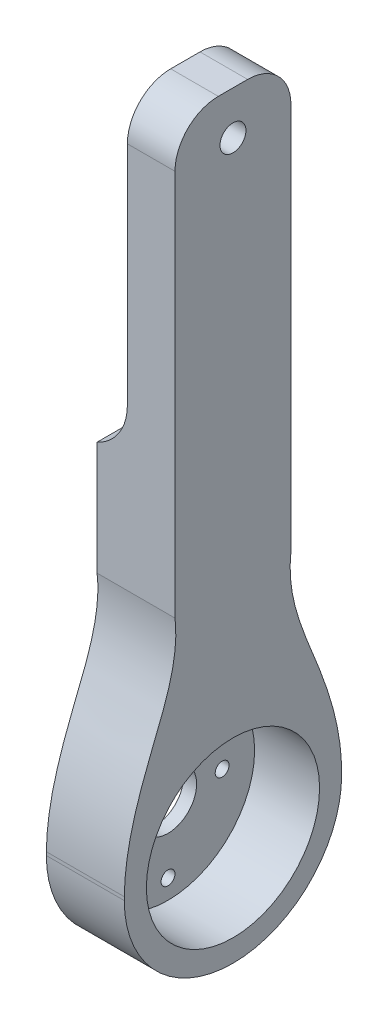
ISO-10303-21;
HEADER;
FILE_DESCRIPTION(('STEP AP214'),'2;1');
FILE_NAME('part.step','',(''),(''),'','','');
FILE_SCHEMA(('AUTOMOTIVE_DESIGN { 1 0 10303 214 1 1 1 1 }'));
ENDSEC;
DATA;
#1=APPLICATION_CONTEXT('core data for automotive mechanical design processes');
#2=APPLICATION_PROTOCOL_DEFINITION('international standard','automotive_design',2000,#1);
#3=PRODUCT_CONTEXT('',#1,'mechanical');
#4=PRODUCT('Part','Part','',(#3));
#5=PRODUCT_RELATED_PRODUCT_CATEGORY('part','',(#4));
#6=PRODUCT_DEFINITION_FORMATION('','',#4);
#7=PRODUCT_DEFINITION_CONTEXT('part definition',#1,'design');
#8=PRODUCT_DEFINITION('design','',#6,#7);
#9=PRODUCT_DEFINITION_SHAPE('','',#8);
#10=(LENGTH_UNIT() NAMED_UNIT(*) SI_UNIT(.MILLI.,.METRE.));
#11=(NAMED_UNIT(*) PLANE_ANGLE_UNIT() SI_UNIT($,.RADIAN.));
#12=(NAMED_UNIT(*) SI_UNIT($,.STERADIAN.) SOLID_ANGLE_UNIT());
#13=UNCERTAINTY_MEASURE_WITH_UNIT(LENGTH_MEASURE(1.E-05),#10,'distance_accuracy_value','');
#14=(GEOMETRIC_REPRESENTATION_CONTEXT(3) GLOBAL_UNCERTAINTY_ASSIGNED_CONTEXT((#13)) GLOBAL_UNIT_ASSIGNED_CONTEXT((#10,
#11,#12)) REPRESENTATION_CONTEXT('',''));
#15=CARTESIAN_POINT('',(0.,0.,0.));
#16=DIRECTION('',(0.,0.,1.));
#17=DIRECTION('',(1.,0.,0.));
#18=AXIS2_PLACEMENT_3D('',#15,#16,#17);
#19=CARTESIAN_POINT('',(1.5,10.8267780737383,-2.98337884698565));
#20=DIRECTION('',(1.,0.,0.));
#21=DIRECTION('',(0.,0.,-1.));
#22=AXIS2_PLACEMENT_3D('',#19,#20,#21);
#23=PLANE('',#22);
#24=CARTESIAN_POINT('',(1.5,10.8267780737383,-2.98337884698565));
#25=DIRECTION('',(1.,0.,0.));
#26=DIRECTION('',(0.,0.,-1.));
#27=AXIS2_PLACEMENT_3D('',#24,#25,#26);
#28=CIRCLE('',#27,3.30176779282932);
#29=CARTESIAN_POINT('',(1.5,10.8267780737383,-6.28514663981497));
#30=VERTEX_POINT('',#29);
#31=EDGE_CURVE('E219',#30,#30,#28,.T.);
#32=ORIENTED_EDGE('',*,*,#31,.F.);
#33=EDGE_LOOP('',(#32));
#34=FACE_BOUND('',#33,.T.);
#35=CARTESIAN_POINT('',(1.5,3.07677807373827,-2.98337884698565));
#36=DIRECTION('',(1.,0.,0.));
#37=DIRECTION('',(0.,0.,-1.));
#38=AXIS2_PLACEMENT_3D('',#35,#36,#37);
#39=CIRCLE('',#38,0.799999999999999);
#40=CARTESIAN_POINT('',(1.5,3.07677807373827,-3.78337884698565));
#41=VERTEX_POINT('',#40);
#42=EDGE_CURVE('E231',#41,#41,#39,.T.);
#43=ORIENTED_EDGE('',*,*,#42,.F.);
#44=EDGE_LOOP('',(#43));
#45=FACE_BOUND('',#44,.T.);
#46=CARTESIAN_POINT('',(1.5,10.8267780737383,-2.98337884698565));
#47=DIRECTION('',(1.,0.,0.));
#48=DIRECTION('',(0.,0.,-1.));
#49=AXIS2_PLACEMENT_3D('',#46,#47,#48);
#50=CIRCLE('',#49,10.);
#51=CARTESIAN_POINT('',(1.5,10.8267780737383,-12.9833788469857));
#52=VERTEX_POINT('',#51);
#53=EDGE_CURVE('E208',#52,#52,#50,.T.);
#54=ORIENTED_EDGE('',*,*,#53,.T.);
#55=EDGE_LOOP('',(#54));
#56=FACE_BOUND('',#55,.T.);
#57=CARTESIAN_POINT('',(1.5,18.5767780737383,-2.98337884698565));
#58=DIRECTION('',(1.,0.,0.));
#59=DIRECTION('',(0.,0.,-1.));
#60=AXIS2_PLACEMENT_3D('',#57,#58,#59);
#61=CIRCLE('',#60,0.8);
#62=CARTESIAN_POINT('',(1.5,18.5767780737383,-3.78337884698565));
#63=VERTEX_POINT('',#62);
#64=EDGE_CURVE('E237',#63,#63,#61,.T.);
#65=ORIENTED_EDGE('',*,*,#64,.F.);
#66=EDGE_LOOP('',(#65));
#67=FACE_BOUND('',#66,.T.);
#68=CARTESIAN_POINT('',(1.5,10.8267780737383,3.26662115301435));
#69=DIRECTION('',(1.,0.,0.));
#70=DIRECTION('',(0.,0.,-1.));
#71=AXIS2_PLACEMENT_3D('',#68,#69,#70);
#72=CIRCLE('',#71,0.8);
#73=CARTESIAN_POINT('',(1.5,10.8267780737383,2.46662115301435));
#74=VERTEX_POINT('',#73);
#75=EDGE_CURVE('E225',#74,#74,#72,.T.);
#76=ORIENTED_EDGE('',*,*,#75,.F.);
#77=EDGE_LOOP('',(#76));
#78=FACE_BOUND('',#77,.T.);
#79=CARTESIAN_POINT('',(1.5,10.8267780737383,-9.23337884698565));
#80=DIRECTION('',(1.,0.,0.));
#81=DIRECTION('',(0.,0.,-1.));
#82=AXIS2_PLACEMENT_3D('',#79,#80,#81);
#83=CIRCLE('',#82,0.800000000000001);
#84=CARTESIAN_POINT('',(1.5,10.8267780737383,-10.0333788469857));
#85=VERTEX_POINT('',#84);
#86=EDGE_CURVE('E213',#85,#85,#83,.T.);
#87=ORIENTED_EDGE('',*,*,#86,.F.);
#88=EDGE_LOOP('',(#87));
#89=FACE_BOUND('',#88,.T.);
#90=ADVANCED_FACE('F35',(#34,#45,#56,#67,#78,#89),#23,.T.);
#91=CARTESIAN_POINT('',(0.,10.8267780737383,-2.98337884698565));
#92=DIRECTION('',(1.,0.,0.));
#93=DIRECTION('',(0.,0.,-1.));
#94=AXIS2_PLACEMENT_3D('',#91,#92,#93);
#95=PLANE('',#94);
#96=CARTESIAN_POINT('',(0.,18.5767780737383,-2.98337884698565));
#97=DIRECTION('',(1.,0.,0.));
#98=DIRECTION('',(0.,0.,-1.));
#99=AXIS2_PLACEMENT_3D('',#96,#97,#98);
#100=CIRCLE('',#99,0.8);
#101=CARTESIAN_POINT('',(0.,18.5767780737383,-3.78337884698565));
#102=VERTEX_POINT('',#101);
#103=EDGE_CURVE('E234',#102,#102,#100,.T.);
#104=ORIENTED_EDGE('',*,*,#103,.T.);
#105=EDGE_LOOP('',(#104));
#106=FACE_BOUND('',#105,.T.);
#107=CARTESIAN_POINT('',(0.,3.07677807373827,-2.98337884698565));
#108=DIRECTION('',(1.,0.,0.));
#109=DIRECTION('',(0.,0.,-1.));
#110=AXIS2_PLACEMENT_3D('',#107,#108,#109);
#111=CIRCLE('',#110,0.799999999999999);
#112=CARTESIAN_POINT('',(0.,3.07677807373827,-3.78337884698565));
#113=VERTEX_POINT('',#112);
#114=EDGE_CURVE('E228',#113,#113,#111,.T.);
#115=ORIENTED_EDGE('',*,*,#114,.T.);
#116=EDGE_LOOP('',(#115));
#117=FACE_BOUND('',#116,.T.);
#118=CARTESIAN_POINT('',(0.,10.8267780737383,3.26662115301435));
#119=DIRECTION('',(1.,0.,0.));
#120=DIRECTION('',(0.,0.,-1.));
#121=AXIS2_PLACEMENT_3D('',#118,#119,#120);
#122=CIRCLE('',#121,0.8);
#123=CARTESIAN_POINT('',(0.,10.8267780737383,2.46662115301435));
#124=VERTEX_POINT('',#123);
#125=EDGE_CURVE('E222',#124,#124,#122,.T.);
#126=ORIENTED_EDGE('',*,*,#125,.T.);
#127=EDGE_LOOP('',(#126));
#128=FACE_BOUND('',#127,.T.);
#129=CARTESIAN_POINT('',(0.,10.8267780737383,-2.98337884698565));
#130=DIRECTION('',(1.,0.,0.));
#131=DIRECTION('',(0.,0.,-1.));
#132=AXIS2_PLACEMENT_3D('',#129,#130,#131);
#133=CIRCLE('',#132,3.30176779282932);
#134=CARTESIAN_POINT('',(0.,10.8267780737383,-6.28514663981497));
#135=VERTEX_POINT('',#134);
#136=EDGE_CURVE('E216',#135,#135,#133,.T.);
#137=ORIENTED_EDGE('',*,*,#136,.T.);
#138=EDGE_LOOP('',(#137));
#139=FACE_BOUND('',#138,.T.);
#140=CARTESIAN_POINT('',(0.,10.8267780737383,-9.23337884698565));
#141=DIRECTION('',(1.,0.,0.));
#142=DIRECTION('',(0.,0.,-1.));
#143=AXIS2_PLACEMENT_3D('',#140,#141,#142);
#144=CIRCLE('',#143,0.800000000000001);
#145=CARTESIAN_POINT('',(0.,10.8267780737383,-10.0333788469857));
#146=VERTEX_POINT('',#145);
#147=EDGE_CURVE('E212',#146,#146,#144,.T.);
#148=ORIENTED_EDGE('',*,*,#147,.T.);
#149=EDGE_LOOP('',(#148));
#150=FACE_BOUND('',#149,.T.);
#151=DIRECTION('',(0.,1.,0.));
#152=VECTOR('',#151,1.);
#153=CARTESIAN_POINT('',(0.,36.1504126638392,3.70951793858332));
#154=LINE('',#153,#152);
#155=CARTESIAN_POINT('',(0.,36.1504126638392,3.70951793858332));
#156=VERTEX_POINT('',#155);
#157=CARTESIAN_POINT('',(0.,49.2404935822916,3.70951793858332));
#158=VERTEX_POINT('',#157);
#159=EDGE_CURVE('E261',#156,#158,#154,.T.);
#160=ORIENTED_EDGE('',*,*,#159,.T.);
#161=DIRECTION('',(0.,0.,-1.));
#162=VECTOR('',#161,1.);
#163=CARTESIAN_POINT('',(0.,49.2404935822916,-2.98337884698565));
#164=LINE('',#163,#162);
#165=CARTESIAN_POINT('',(0.,49.2404935822916,-9.67627563255461));
#166=VERTEX_POINT('',#165);
#167=EDGE_CURVE('E336',#158,#166,#164,.T.);
#168=ORIENTED_EDGE('',*,*,#167,.T.);
#169=DIRECTION('',(0.,-1.,0.));
#170=VECTOR('',#169,1.);
#171=CARTESIAN_POINT('',(0.,36.1504126638392,-9.67627563255461));
#172=LINE('',#171,#170);
#173=CARTESIAN_POINT('',(0.,36.1504126638392,-9.67627563255461));
#174=VERTEX_POINT('',#173);
#175=EDGE_CURVE('E258',#166,#174,#172,.T.);
#176=ORIENTED_EDGE('',*,*,#175,.T.);
#177=CARTESIAN_POINT('',(0.,36.1504126638392,-9.67627563255462));
#178=CARTESIAN_POINT('',(0.,31.470187844211,-9.12188079241383));
#179=CARTESIAN_POINT('',(0.,23.501097027703,-13.0526548593357));
#180=CARTESIAN_POINT('',(0.,15.1167109755813,-15.5695494666407));
#181=CARTESIAN_POINT('',(0.,10.8267780737383,-15.5319237412449));
#182=B_SPLINE_CURVE_WITH_KNOTS('',3,(#177,#178,#179,#180,#181),.UNSPECIFIED.,.F.,.F.,(4,1,4),
(0.,0.516043618335401,1.),.UNSPECIFIED.);
#183=CARTESIAN_POINT('',(0.,11.2146572929089,-15.5319237418595));
#184=VERTEX_POINT('',#183);
#185=EDGE_CURVE('E256',#174,#184,#182,.T.);
#186=ORIENTED_EDGE('',*,*,#185,.T.);
#187=DIRECTION('',(0.,-1.,0.));
#188=VECTOR('',#187,1.);
#189=CARTESIAN_POINT('',(0.,85.8267780737383,-15.531923741245));
#190=LINE('',#189,#188);
#191=CARTESIAN_POINT('',(0.,10.8267780737383,-15.5319237412449));
#192=VERTEX_POINT('',#191);
#193=EDGE_CURVE('E203',#184,#192,#190,.T.);
#194=ORIENTED_EDGE('',*,*,#193,.T.);
#195=CARTESIAN_POINT('',(0.,10.8267780737383,-2.98337884698565));
#196=DIRECTION('',(-1.,0.,0.));
#197=DIRECTION('',(0.,0.,1.));
#198=AXIS2_PLACEMENT_3D('',#195,#196,#197);
#199=CIRCLE('',#198,12.5485448942593);
#200=CARTESIAN_POINT('',(0.,10.8267780737383,9.56516604727364));
#201=VERTEX_POINT('',#200);
#202=EDGE_CURVE('E196',#192,#201,#199,.T.);
#203=ORIENTED_EDGE('',*,*,#202,.T.);
#204=DIRECTION('',(0.,1.,0.));
#205=VECTOR('',#204,1.);
#206=CARTESIAN_POINT('',(0.,85.8267780737383,9.56516604727363));
#207=LINE('',#206,#205);
#208=CARTESIAN_POINT('',(0.,11.214657292909,9.56516604788818));
#209=VERTEX_POINT('',#208);
#210=EDGE_CURVE('E199',#201,#209,#207,.T.);
#211=ORIENTED_EDGE('',*,*,#210,.T.);
#212=CARTESIAN_POINT('',(0.,10.8267780737383,9.56516604727364));
#213=CARTESIAN_POINT('',(0.,15.1167109755813,9.6027917726694));
#214=CARTESIAN_POINT('',(0.,23.501097027703,7.08589716536438));
#215=CARTESIAN_POINT('',(0.,31.470187844211,3.15512309844253));
#216=CARTESIAN_POINT('',(0.,36.1504126638392,3.70951793858332));
#217=B_SPLINE_CURVE_WITH_KNOTS('',3,(#212,#213,#214,#215,#216),.UNSPECIFIED.,.F.,.F.,(4,1,4),
(0.,0.483956381664599,1.),.UNSPECIFIED.);
#218=EDGE_CURVE('E257',#209,#156,#217,.T.);
#219=ORIENTED_EDGE('',*,*,#218,.T.);
#220=EDGE_LOOP('',(#160,#168,#176,#186,#194,#203,#211,#219));
#221=FACE_BOUND('',#220,.T.);
#222=ADVANCED_FACE('F283',(#106,#117,#128,#139,#150,#221),#95,.F.);
#223=CARTESIAN_POINT('',(1.5,18.5767780737383,-2.98337884698565));
#224=DIRECTION('',(-1.,0.,0.));
#225=DIRECTION('',(0.,0.,1.));
#226=AXIS2_PLACEMENT_3D('',#223,#224,#225);
#227=CYLINDRICAL_SURFACE('',#226,0.8);
#228=ORIENTED_EDGE('',*,*,#64,.T.);
#229=EDGE_LOOP('',(#228));
#230=FACE_BOUND('',#229,.T.);
#231=ORIENTED_EDGE('',*,*,#103,.F.);
#232=EDGE_LOOP('',(#231));
#233=FACE_BOUND('',#232,.T.);
#234=ADVANCED_FACE('F303',(#230,#233),#227,.F.);
#235=CARTESIAN_POINT('',(1.5,3.07677807373827,-2.98337884698565));
#236=DIRECTION('',(-1.,0.,0.));
#237=DIRECTION('',(0.,0.,1.));
#238=AXIS2_PLACEMENT_3D('',#235,#236,#237);
#239=CYLINDRICAL_SURFACE('',#238,0.799999999999999);
#240=ORIENTED_EDGE('',*,*,#42,.T.);
#241=EDGE_LOOP('',(#240));
#242=FACE_BOUND('',#241,.T.);
#243=ORIENTED_EDGE('',*,*,#114,.F.);
#244=EDGE_LOOP('',(#243));
#245=FACE_BOUND('',#244,.T.);
#246=ADVANCED_FACE('F380',(#242,#245),#239,.F.);
#247=CARTESIAN_POINT('',(1.5,10.8267780737383,3.26662115301435));
#248=DIRECTION('',(-1.,0.,0.));
#249=DIRECTION('',(0.,0.,1.));
#250=AXIS2_PLACEMENT_3D('',#247,#248,#249);
#251=CYLINDRICAL_SURFACE('',#250,0.8);
#252=ORIENTED_EDGE('',*,*,#75,.T.);
#253=EDGE_LOOP('',(#252));
#254=FACE_BOUND('',#253,.T.);
#255=ORIENTED_EDGE('',*,*,#125,.F.);
#256=EDGE_LOOP('',(#255));
#257=FACE_BOUND('',#256,.T.);
#258=ADVANCED_FACE('F377',(#254,#257),#251,.F.);
#259=CARTESIAN_POINT('',(1.5,10.8267780737383,-2.98337884698565));
#260=DIRECTION('',(-1.,0.,0.));
#261=DIRECTION('',(0.,0.,1.));
#262=AXIS2_PLACEMENT_3D('',#259,#260,#261);
#263=CYLINDRICAL_SURFACE('',#262,3.30176779282932);
#264=ORIENTED_EDGE('',*,*,#31,.T.);
#265=EDGE_LOOP('',(#264));
#266=FACE_BOUND('',#265,.T.);
#267=ORIENTED_EDGE('',*,*,#136,.F.);
#268=EDGE_LOOP('',(#267));
#269=FACE_BOUND('',#268,.T.);
#270=ADVANCED_FACE('F373',(#266,#269),#263,.F.);
#271=CARTESIAN_POINT('',(1.5,10.8267780737383,-9.23337884698565));
#272=DIRECTION('',(-1.,0.,0.));
#273=DIRECTION('',(0.,0.,1.));
#274=AXIS2_PLACEMENT_3D('',#271,#272,#273);
#275=CYLINDRICAL_SURFACE('',#274,0.800000000000001);
#276=ORIENTED_EDGE('',*,*,#86,.T.);
#277=EDGE_LOOP('',(#276));
#278=FACE_BOUND('',#277,.T.);
#279=ORIENTED_EDGE('',*,*,#147,.F.);
#280=EDGE_LOOP('',(#279));
#281=FACE_BOUND('',#280,.T.);
#282=ADVANCED_FACE('F294',(#278,#281),#275,.F.);
#283=CARTESIAN_POINT('',(9.,10.8267780737383,-2.98337884698565));
#284=DIRECTION('',(-1.,0.,0.));
#285=DIRECTION('',(0.,0.,1.));
#286=AXIS2_PLACEMENT_3D('',#283,#284,#285);
#287=CYLINDRICAL_SURFACE('',#286,12.5485448942593);
#288=ORIENTED_EDGE('',*,*,#202,.F.);
#289=DIRECTION('',(-1.,0.,0.));
#290=VECTOR('',#289,1.);
#291=CARTESIAN_POINT('',(9.,10.8267780737383,-15.5319237412449));
#292=LINE('',#291,#290);
#293=CARTESIAN_POINT('',(9.,10.8267780737383,-15.5319237412449));
#294=VERTEX_POINT('',#293);
#295=EDGE_CURVE('E205',#294,#192,#292,.T.);
#296=ORIENTED_EDGE('',*,*,#295,.F.);
#297=CARTESIAN_POINT('',(9.,10.8267780737383,-2.98337884698565));
#298=DIRECTION('',(-1.,0.,0.));
#299=DIRECTION('',(0.,0.,1.));
#300=AXIS2_PLACEMENT_3D('',#297,#298,#299);
#301=CIRCLE('',#300,12.5485448942593);
#302=CARTESIAN_POINT('',(9.,10.8267780737383,9.56516604727364));
#303=VERTEX_POINT('',#302);
#304=EDGE_CURVE('E192',#294,#303,#301,.T.);
#305=ORIENTED_EDGE('',*,*,#304,.T.);
#306=DIRECTION('',(-1.,0.,0.));
#307=VECTOR('',#306,1.);
#308=CARTESIAN_POINT('',(9.,10.8267780737383,9.56516604727364));
#309=LINE('',#308,#307);
#310=EDGE_CURVE('E189',#303,#201,#309,.T.);
#311=ORIENTED_EDGE('',*,*,#310,.T.);
#312=EDGE_LOOP('',(#288,#296,#305,#311));
#313=FACE_BOUND('',#312,.T.);
#314=ADVANCED_FACE('F275',(#313),#287,.T.);
#315=CARTESIAN_POINT('',(9.,85.8267780737383,-15.531923741245));
#316=DIRECTION('',(0.,0.,-1.));
#317=DIRECTION('',(0.,1.,0.));
#318=AXIS2_PLACEMENT_3D('',#315,#316,#317);
#319=PLANE('',#318);
#320=DIRECTION('',(1.,0.,0.));
#321=VECTOR('',#320,1.);
#322=CARTESIAN_POINT('',(0.,11.2146573628351,-15.5319237412488));
#323=LINE('',#322,#321);
#324=CARTESIAN_POINT('',(9.,11.2146572929089,-15.5319237418595));
#325=VERTEX_POINT('',#324);
#326=EDGE_CURVE('E244',#325,#184,#323,.F.);
#327=ORIENTED_EDGE('',*,*,#326,.F.);
#328=DIRECTION('',(0.,-1.,0.));
#329=VECTOR('',#328,1.);
#330=CARTESIAN_POINT('',(9.,85.8267780737383,-15.531923741245));
#331=LINE('',#330,#329);
#332=EDGE_CURVE('E186',#325,#294,#331,.T.);
#333=ORIENTED_EDGE('',*,*,#332,.T.);
#334=ORIENTED_EDGE('',*,*,#295,.T.);
#335=ORIENTED_EDGE('',*,*,#193,.F.);
#336=EDGE_LOOP('',(#327,#333,#334,#335));
#337=FACE_BOUND('',#336,.T.);
#338=ADVANCED_FACE('F286',(#337),#319,.T.);
#339=CARTESIAN_POINT('',(9.,85.8267780737383,-15.531923741245));
#340=DIRECTION('',(0.,1.,0.));
#341=DIRECTION('',(0.,0.,1.));
#342=AXIS2_PLACEMENT_3D('',#339,#340,#341);
#343=PLANE('',#342);
#344=DIRECTION('',(0.,0.,-1.));
#345=VECTOR('',#344,1.);
#346=CARTESIAN_POINT('',(3.5,85.8267780737383,-15.531923741245));
#347=LINE('',#346,#345);
#348=CARTESIAN_POINT('',(3.5,85.8267780737383,-1.29048206141669));
#349=VERTEX_POINT('',#348);
#350=CARTESIAN_POINT('',(3.5,85.8267780737383,-4.67627563255462));
#351=VERTEX_POINT('',#350);
#352=EDGE_CURVE('E125',#349,#351,#347,.T.);
#353=ORIENTED_EDGE('',*,*,#352,.F.);
#354=DIRECTION('',(-1.,0.,0.));
#355=VECTOR('',#354,1.);
#356=CARTESIAN_POINT('',(9.,85.8267780737383,-1.29048206141668));
#357=LINE('',#356,#355);
#358=CARTESIAN_POINT('',(9.,85.8267780737383,-1.29048206141669));
#359=VERTEX_POINT('',#358);
#360=EDGE_CURVE('E138',#349,#359,#357,.F.);
#361=ORIENTED_EDGE('',*,*,#360,.T.);
#362=DIRECTION('',(0.,0.,-1.));
#363=VECTOR('',#362,1.);
#364=CARTESIAN_POINT('',(9.,85.8267780737383,-15.531923741245));
#365=LINE('',#364,#363);
#366=CARTESIAN_POINT('',(9.,85.8267780737383,-4.67627563255462));
#367=VERTEX_POINT('',#366);
#368=EDGE_CURVE('E184',#359,#367,#365,.T.);
#369=ORIENTED_EDGE('',*,*,#368,.T.);
#370=DIRECTION('',(1.,0.,0.));
#371=VECTOR('',#370,1.);
#372=CARTESIAN_POINT('',(0.,85.8267780737383,-4.67627563255461));
#373=LINE('',#372,#371);
#374=EDGE_CURVE('E141',#367,#351,#373,.F.);
#375=ORIENTED_EDGE('',*,*,#374,.T.);
#376=EDGE_LOOP('',(#353,#361,#369,#375));
#377=FACE_BOUND('',#376,.T.);
#378=ADVANCED_FACE('F136',(#377),#343,.T.);
#379=CARTESIAN_POINT('',(9.,85.8267780737383,9.56516604727363));
#380=DIRECTION('',(0.,0.,1.));
#381=DIRECTION('',(0.,-1.,0.));
#382=AXIS2_PLACEMENT_3D('',#379,#380,#381);
#383=PLANE('',#382);
#384=DIRECTION('',(1.,0.,0.));
#385=VECTOR('',#384,1.);
#386=CARTESIAN_POINT('',(0.,11.214657363274,9.56516604727364));
#387=LINE('',#386,#385);
#388=CARTESIAN_POINT('',(9.,11.214657292909,9.56516604788818));
#389=VERTEX_POINT('',#388);
#390=EDGE_CURVE('E267',#209,#389,#387,.T.);
#391=ORIENTED_EDGE('',*,*,#390,.F.);
#392=ORIENTED_EDGE('',*,*,#210,.F.);
#393=ORIENTED_EDGE('',*,*,#310,.F.);
#394=DIRECTION('',(0.,1.,0.));
#395=VECTOR('',#394,1.);
#396=CARTESIAN_POINT('',(9.,85.8267780737383,9.56516604727363));
#397=LINE('',#396,#395);
#398=EDGE_CURVE('E187',#303,#389,#397,.T.);
#399=ORIENTED_EDGE('',*,*,#398,.T.);
#400=EDGE_LOOP('',(#391,#392,#393,#399));
#401=FACE_BOUND('',#400,.T.);
#402=ADVANCED_FACE('F280',(#401),#383,.T.);
#403=CARTESIAN_POINT('',(9.,10.8267780737383,-2.98337884698565));
#404=DIRECTION('',(-1.,0.,0.));
#405=DIRECTION('',(0.,0.,1.));
#406=AXIS2_PLACEMENT_3D('',#403,#404,#405);
#407=PLANE('',#406);
#408=CARTESIAN_POINT('',(9.,80.8267780737383,-2.98337884698565));
#409=DIRECTION('',(-1.,0.,0.));
#410=DIRECTION('',(0.,0.,1.));
#411=AXIS2_PLACEMENT_3D('',#408,#409,#410);
#412=CIRCLE('',#411,1.5);
#413=CARTESIAN_POINT('',(9.,80.8267780737383,-1.48337884698565));
#414=VERTEX_POINT('',#413);
#415=EDGE_CURVE('E242',#414,#414,#412,.T.);
#416=ORIENTED_EDGE('',*,*,#415,.T.);
#417=EDGE_LOOP('',(#416));
#418=FACE_BOUND('',#417,.T.);
#419=CARTESIAN_POINT('',(9.,10.8267780737383,-2.98337884698565));
#420=DIRECTION('',(-1.,0.,0.));
#421=DIRECTION('',(0.,0.,1.));
#422=AXIS2_PLACEMENT_3D('',#419,#420,#421);
#423=CIRCLE('',#422,10.);
#424=CARTESIAN_POINT('',(9.,10.8267780737383,7.01662115301436));
#425=VERTEX_POINT('',#424);
#426=EDGE_CURVE('E200',#425,#425,#423,.T.);
#427=ORIENTED_EDGE('',*,*,#426,.T.);
#428=EDGE_LOOP('',(#427));
#429=FACE_BOUND('',#428,.T.);
#430=DIRECTION('',(0.,1.,0.));
#431=VECTOR('',#430,1.);
#432=CARTESIAN_POINT('',(9.,10.8267780737383,-9.67627563255461));
#433=LINE('',#432,#431);
#434=CARTESIAN_POINT('',(9.,36.1504126638392,-9.67627563255461));
#435=VERTEX_POINT('',#434);
#436=CARTESIAN_POINT('',(9.,80.8267780737383,-9.67627563255461));
#437=VERTEX_POINT('',#436);
#438=EDGE_CURVE('E171',#435,#437,#433,.T.);
#439=ORIENTED_EDGE('',*,*,#438,.T.);
#440=CARTESIAN_POINT('',(9.,80.8267780737383,-4.67627563255461));
#441=DIRECTION('',(-1.,0.,0.));
#442=DIRECTION('',(0.,0.,1.));
#443=AXIS2_PLACEMENT_3D('',#440,#441,#442);
#444=CIRCLE('',#443,5.);
#445=EDGE_CURVE('E147',#437,#367,#444,.F.);
#446=ORIENTED_EDGE('',*,*,#445,.T.);
#447=ORIENTED_EDGE('',*,*,#368,.F.);
#448=CARTESIAN_POINT('',(9.,80.8267780737383,-1.29048206141668));
#449=DIRECTION('',(-1.,0.,0.));
#450=DIRECTION('',(0.,0.,1.));
#451=AXIS2_PLACEMENT_3D('',#448,#449,#450);
#452=CIRCLE('',#451,5.);
#453=CARTESIAN_POINT('',(9.,80.8267780737383,3.70951793858332));
#454=VERTEX_POINT('',#453);
#455=EDGE_CURVE('E146',#359,#454,#452,.F.);
#456=ORIENTED_EDGE('',*,*,#455,.T.);
#457=DIRECTION('',(0.,-1.,0.));
#458=VECTOR('',#457,1.);
#459=CARTESIAN_POINT('',(9.,10.8267780737383,3.70951793858332));
#460=LINE('',#459,#458);
#461=CARTESIAN_POINT('',(9.,36.1504126638392,3.70951793858332));
#462=VERTEX_POINT('',#461);
#463=EDGE_CURVE('E159',#454,#462,#460,.T.);
#464=ORIENTED_EDGE('',*,*,#463,.T.);
#465=CARTESIAN_POINT('',(9.,10.8267780737383,9.56516604727364));
#466=CARTESIAN_POINT('',(9.,15.1167109755813,9.6027917726694));
#467=CARTESIAN_POINT('',(9.,23.501097027703,7.08589716536438));
#468=CARTESIAN_POINT('',(9.,31.470187844211,3.15512309844253));
#469=CARTESIAN_POINT('',(9.,36.1504126638392,3.70951793858332));
#470=B_SPLINE_CURVE_WITH_KNOTS('',3,(#465,#466,#467,#468,#469),.UNSPECIFIED.,.F.,.F.,(4,1,4),
(0.,0.483956381664599,1.),.UNSPECIFIED.);
#471=EDGE_CURVE('E165',#462,#389,#470,.F.);
#472=ORIENTED_EDGE('',*,*,#471,.T.);
#473=ORIENTED_EDGE('',*,*,#398,.F.);
#474=ORIENTED_EDGE('',*,*,#304,.F.);
#475=ORIENTED_EDGE('',*,*,#332,.F.);
#476=CARTESIAN_POINT('',(9.,36.1504126638392,-9.67627563255462));
#477=CARTESIAN_POINT('',(9.,31.470187844211,-9.12188079241383));
#478=CARTESIAN_POINT('',(9.,23.501097027703,-13.0526548593357));
#479=CARTESIAN_POINT('',(9.,15.1167109755813,-15.5695494666407));
#480=CARTESIAN_POINT('',(9.,10.8267780737383,-15.5319237412449));
#481=B_SPLINE_CURVE_WITH_KNOTS('',3,(#476,#477,#478,#479,#480),.UNSPECIFIED.,.F.,.F.,(4,1,4),
(0.,0.516043618335401,1.),.UNSPECIFIED.);
#482=EDGE_CURVE('E166',#325,#435,#481,.F.);
#483=ORIENTED_EDGE('',*,*,#482,.T.);
#484=EDGE_LOOP('',(#439,#446,#447,#456,#464,#472,#473,#474,#475,#483));
#485=FACE_BOUND('',#484,.T.);
#486=ADVANCED_FACE('F183',(#418,#429,#485),#407,.F.);
#487=CARTESIAN_POINT('',(9.,10.8267780737383,-2.98337884698565));
#488=DIRECTION('',(-1.,0.,0.));
#489=DIRECTION('',(0.,0.,1.));
#490=AXIS2_PLACEMENT_3D('',#487,#488,#489);
#491=CYLINDRICAL_SURFACE('',#490,10.);
#492=ORIENTED_EDGE('',*,*,#53,.F.);
#493=EDGE_LOOP('',(#492));
#494=FACE_BOUND('',#493,.T.);
#495=ORIENTED_EDGE('',*,*,#426,.F.);
#496=EDGE_LOOP('',(#495));
#497=FACE_BOUND('',#496,.T.);
#498=ADVANCED_FACE('F353',(#494,#497),#491,.F.);
#499=CARTESIAN_POINT('',(0.,80.8267780737383,-2.98337884698565));
#500=DIRECTION('',(1.,0.,0.));
#501=DIRECTION('',(0.,0.,-1.));
#502=AXIS2_PLACEMENT_3D('',#499,#500,#501);
#503=CYLINDRICAL_SURFACE('',#502,1.5);
#504=CARTESIAN_POINT('',(3.5,80.8267780737383,-2.98337884698565));
#505=DIRECTION('',(1.,0.,0.));
#506=DIRECTION('',(0.,0.,-1.));
#507=AXIS2_PLACEMENT_3D('',#504,#505,#506);
#508=CIRCLE('',#507,1.5);
#509=CARTESIAN_POINT('',(3.5,80.8267780737383,-4.48337884698565));
#510=VERTEX_POINT('',#509);
#511=EDGE_CURVE('E535',#510,#510,#508,.F.);
#512=ORIENTED_EDGE('',*,*,#511,.T.);
#513=EDGE_LOOP('',(#512));
#514=FACE_BOUND('',#513,.T.);
#515=ORIENTED_EDGE('',*,*,#415,.F.);
#516=EDGE_LOOP('',(#515));
#517=FACE_BOUND('',#516,.T.);
#518=ADVANCED_FACE('F350',(#514,#517),#503,.F.);
#519=DIRECTION('',(1.,0.,0.));
#520=VECTOR('',#519,1.);
#521=SURFACE_OF_LINEAR_EXTRUSION('',#182,#520);
#522=ORIENTED_EDGE('',*,*,#326,.T.);
#523=ORIENTED_EDGE('',*,*,#185,.F.);
#524=DIRECTION('',(1.,0.,0.));
#525=VECTOR('',#524,1.);
#526=CARTESIAN_POINT('',(0.,36.1504126638392,-9.67627563255461));
#527=LINE('',#526,#525);
#528=EDGE_CURVE('E249',#174,#435,#527,.T.);
#529=ORIENTED_EDGE('',*,*,#528,.T.);
#530=ORIENTED_EDGE('',*,*,#482,.F.);
#531=EDGE_LOOP('',(#522,#523,#529,#530));
#532=FACE_BOUND('',#531,.T.);
#533=ADVANCED_FACE('F253',(#532),#521,.F.);
#534=CARTESIAN_POINT('',(0.,36.1504126638392,-9.67627563255461));
#535=DIRECTION('',(0.,0.,1.));
#536=DIRECTION('',(1.,0.,0.));
#537=AXIS2_PLACEMENT_3D('',#534,#535,#536);
#538=PLANE('',#537);
#539=ORIENTED_EDGE('',*,*,#175,.F.);
#540=CARTESIAN_POINT('',(-2.5,54.6948496396095,-9.67627563255461));
#541=DIRECTION('',(0.,0.,1.));
#542=DIRECTION('',(1.,0.,0.));
#543=AXIS2_PLACEMENT_3D('',#540,#541,#542);
#544=CIRCLE('',#543,6.);
#545=CARTESIAN_POINT('',(3.5,54.6948496396095,-9.67627563255461));
#546=VERTEX_POINT('',#545);
#547=EDGE_CURVE('E43',#166,#546,#544,.T.);
#548=ORIENTED_EDGE('',*,*,#547,.T.);
#549=DIRECTION('',(0.,1.,0.));
#550=VECTOR('',#549,1.);
#551=CARTESIAN_POINT('',(3.5,36.1504126638392,-9.67627563255461));
#552=LINE('',#551,#550);
#553=CARTESIAN_POINT('',(3.5,80.8267780737383,-9.67627563255461));
#554=VERTEX_POINT('',#553);
#555=EDGE_CURVE('E536',#546,#554,#552,.T.);
#556=ORIENTED_EDGE('',*,*,#555,.T.);
#557=DIRECTION('',(1.,0.,0.));
#558=VECTOR('',#557,1.);
#559=CARTESIAN_POINT('',(9.,80.8267780737383,-9.67627563255461));
#560=LINE('',#559,#558);
#561=EDGE_CURVE('E168',#554,#437,#560,.T.);
#562=ORIENTED_EDGE('',*,*,#561,.T.);
#563=ORIENTED_EDGE('',*,*,#438,.F.);
#564=ORIENTED_EDGE('',*,*,#528,.F.);
#565=EDGE_LOOP('',(#539,#548,#556,#562,#563,#564));
#566=FACE_BOUND('',#565,.T.);
#567=ADVANCED_FACE('F248',(#566),#538,.F.);
#568=DIRECTION('',(1.,0.,0.));
#569=VECTOR('',#568,1.);
#570=SURFACE_OF_LINEAR_EXTRUSION('',#217,#569);
#571=ORIENTED_EDGE('',*,*,#390,.T.);
#572=ORIENTED_EDGE('',*,*,#471,.F.);
#573=DIRECTION('',(1.,0.,0.));
#574=VECTOR('',#573,1.);
#575=CARTESIAN_POINT('',(0.,36.1504126638392,3.70951793858332));
#576=LINE('',#575,#574);
#577=EDGE_CURVE('E161',#156,#462,#576,.T.);
#578=ORIENTED_EDGE('',*,*,#577,.F.);
#579=ORIENTED_EDGE('',*,*,#218,.F.);
#580=EDGE_LOOP('',(#571,#572,#578,#579));
#581=FACE_BOUND('',#580,.T.);
#582=ADVANCED_FACE('F326',(#581),#570,.F.);
#583=CARTESIAN_POINT('',(0.,36.1504126638392,3.70951793858332));
#584=DIRECTION('',(0.,0.,-1.));
#585=DIRECTION('',(-1.,0.,0.));
#586=AXIS2_PLACEMENT_3D('',#583,#584,#585);
#587=PLANE('',#586);
#588=DIRECTION('',(-1.,0.,0.));
#589=VECTOR('',#588,1.);
#590=CARTESIAN_POINT('',(0.,80.8267780737383,3.70951793858332));
#591=LINE('',#590,#589);
#592=CARTESIAN_POINT('',(3.5,80.8267780737383,3.70951793858332));
#593=VERTEX_POINT('',#592);
#594=EDGE_CURVE('E132',#454,#593,#591,.T.);
#595=ORIENTED_EDGE('',*,*,#594,.T.);
#596=DIRECTION('',(0.,-1.,0.));
#597=VECTOR('',#596,1.);
#598=CARTESIAN_POINT('',(3.5,36.1504126638392,3.70951793858332));
#599=LINE('',#598,#597);
#600=CARTESIAN_POINT('',(3.5,54.6948496396095,3.70951793858332));
#601=VERTEX_POINT('',#600);
#602=EDGE_CURVE('E127',#593,#601,#599,.T.);
#603=ORIENTED_EDGE('',*,*,#602,.T.);
#604=CARTESIAN_POINT('',(-2.5,54.6948496396095,3.70951793858332));
#605=DIRECTION('',(0.,0.,-1.));
#606=DIRECTION('',(-1.,0.,0.));
#607=AXIS2_PLACEMENT_3D('',#604,#605,#606);
#608=CIRCLE('',#607,6.);
#609=EDGE_CURVE('E11',#601,#158,#608,.T.);
#610=ORIENTED_EDGE('',*,*,#609,.T.);
#611=ORIENTED_EDGE('',*,*,#159,.F.);
#612=ORIENTED_EDGE('',*,*,#577,.T.);
#613=ORIENTED_EDGE('',*,*,#463,.F.);
#614=EDGE_LOOP('',(#595,#603,#610,#611,#612,#613));
#615=FACE_BOUND('',#614,.T.);
#616=ADVANCED_FACE('F156',(#615),#587,.F.);
#617=CARTESIAN_POINT('',(0.,80.8267780737383,-4.67627563255461));
#618=DIRECTION('',(-1.,0.,0.));
#619=DIRECTION('',(0.,0.,1.));
#620=AXIS2_PLACEMENT_3D('',#617,#618,#619);
#621=CYLINDRICAL_SURFACE('',#620,5.);
#622=CARTESIAN_POINT('',(3.5,80.8267780737383,-4.67627563255461));
#623=DIRECTION('',(1.,0.,0.));
#624=DIRECTION('',(0.,0.,-1.));
#625=AXIS2_PLACEMENT_3D('',#622,#623,#624);
#626=CIRCLE('',#625,5.);
#627=EDGE_CURVE('E142',#351,#554,#626,.F.);
#628=ORIENTED_EDGE('',*,*,#627,.F.);
#629=ORIENTED_EDGE('',*,*,#374,.F.);
#630=ORIENTED_EDGE('',*,*,#445,.F.);
#631=ORIENTED_EDGE('',*,*,#561,.F.);
#632=EDGE_LOOP('',(#628,#629,#630,#631));
#633=FACE_BOUND('',#632,.T.);
#634=ADVANCED_FACE('F311',(#633),#621,.T.);
#635=CARTESIAN_POINT('',(0.,80.8267780737383,-1.29048206141668));
#636=DIRECTION('',(1.,0.,0.));
#637=DIRECTION('',(0.,0.,-1.));
#638=AXIS2_PLACEMENT_3D('',#635,#636,#637);
#639=CYLINDRICAL_SURFACE('',#638,5.);
#640=CARTESIAN_POINT('',(3.5,80.8267780737383,-1.29048206141668));
#641=DIRECTION('',(1.,0.,0.));
#642=DIRECTION('',(0.,0.,-1.));
#643=AXIS2_PLACEMENT_3D('',#640,#641,#642);
#644=CIRCLE('',#643,5.);
#645=EDGE_CURVE('E120',#593,#349,#644,.F.);
#646=ORIENTED_EDGE('',*,*,#645,.F.);
#647=ORIENTED_EDGE('',*,*,#594,.F.);
#648=ORIENTED_EDGE('',*,*,#455,.F.);
#649=ORIENTED_EDGE('',*,*,#360,.F.);
#650=EDGE_LOOP('',(#646,#647,#648,#649));
#651=FACE_BOUND('',#650,.T.);
#652=ADVANCED_FACE('F145',(#651),#639,.T.);
#653=CARTESIAN_POINT('',(3.5,95.8916034943828,9.56516604788818));
#654=DIRECTION('',(1.,0.,0.));
#655=DIRECTION('',(0.,0.,-1.));
#656=AXIS2_PLACEMENT_3D('',#653,#654,#655);
#657=PLANE('',#656);
#658=ORIENTED_EDGE('',*,*,#555,.F.);
#659=DIRECTION('',(0.,0.,1.));
#660=VECTOR('',#659,1.);
#661=CARTESIAN_POINT('',(3.5,54.6948496396095,9.56516604788819));
#662=LINE('',#661,#660);
#663=EDGE_CURVE('E56',#546,#601,#662,.T.);
#664=ORIENTED_EDGE('',*,*,#663,.T.);
#665=ORIENTED_EDGE('',*,*,#602,.F.);
#666=ORIENTED_EDGE('',*,*,#645,.T.);
#667=ORIENTED_EDGE('',*,*,#352,.T.);
#668=ORIENTED_EDGE('',*,*,#627,.T.);
#669=EDGE_LOOP('',(#658,#664,#665,#666,#667,#668));
#670=FACE_BOUND('',#669,.T.);
#671=ORIENTED_EDGE('',*,*,#511,.F.);
#672=EDGE_LOOP('',(#671));
#673=FACE_BOUND('',#672,.T.);
#674=ADVANCED_FACE('F122',(#670,#673),#657,.F.);
#675=CARTESIAN_POINT('',(-2.5,54.6948496396095,9.56516604788819));
#676=DIRECTION('',(0.,0.,1.));
#677=DIRECTION('',(0.,-1.,0.));
#678=AXIS2_PLACEMENT_3D('',#675,#676,#677);
#679=CYLINDRICAL_SURFACE('',#678,6.);
#680=ORIENTED_EDGE('',*,*,#609,.F.);
#681=ORIENTED_EDGE('',*,*,#663,.F.);
#682=ORIENTED_EDGE('',*,*,#547,.F.);
#683=ORIENTED_EDGE('',*,*,#167,.F.);
#684=EDGE_LOOP('',(#680,#681,#682,#683));
#685=FACE_BOUND('',#684,.T.);
#686=ADVANCED_FACE('F37',(#685),#679,.F.);
#687=CLOSED_SHELL('',(#90,#222,#234,#246,#258,#270,#282,#314,#338,#378,#402,#486,#498,#518,#533,
#567,#582,#616,#634,#652,#674,#686));
#688=MANIFOLD_SOLID_BREP('B2',#687);
#689=ADVANCED_BREP_SHAPE_REPRESENTATION('',(#18,#688),#14);
#690=SHAPE_DEFINITION_REPRESENTATION(#9,#689);
ENDSEC;
END-ISO-10303-21;
